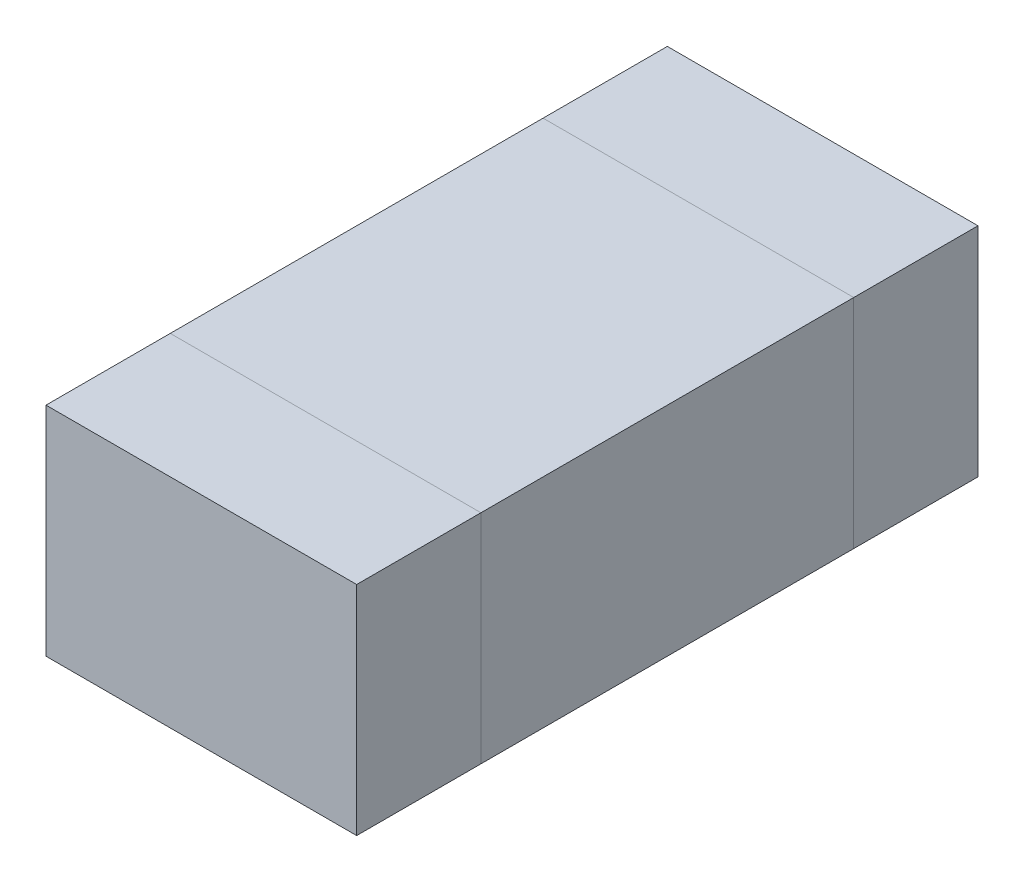
ISO-10303-21;
HEADER;
FILE_DESCRIPTION(('STEP AP214'),'2;1');
FILE_NAME('part.step','',(''),(''),'','','');
FILE_SCHEMA(('AUTOMOTIVE_DESIGN { 1 0 10303 214 1 1 1 1 }'));
ENDSEC;
DATA;
#1=APPLICATION_CONTEXT('core data for automotive mechanical design processes');
#2=APPLICATION_PROTOCOL_DEFINITION('international standard','automotive_design',2000,#1);
#3=PRODUCT_CONTEXT('',#1,'mechanical');
#4=PRODUCT('Part','Part','',(#3));
#5=PRODUCT_RELATED_PRODUCT_CATEGORY('part','',(#4));
#6=PRODUCT_DEFINITION_FORMATION('','',#4);
#7=PRODUCT_DEFINITION_CONTEXT('part definition',#1,'design');
#8=PRODUCT_DEFINITION('design','',#6,#7);
#9=PRODUCT_DEFINITION_SHAPE('','',#8);
#10=(LENGTH_UNIT() NAMED_UNIT(*) SI_UNIT(.MILLI.,.METRE.));
#11=(NAMED_UNIT(*) PLANE_ANGLE_UNIT() SI_UNIT($,.RADIAN.));
#12=(NAMED_UNIT(*) SI_UNIT($,.STERADIAN.) SOLID_ANGLE_UNIT());
#13=UNCERTAINTY_MEASURE_WITH_UNIT(LENGTH_MEASURE(1.E-05),#10,'distance_accuracy_value','');
#14=(GEOMETRIC_REPRESENTATION_CONTEXT(3) GLOBAL_UNCERTAINTY_ASSIGNED_CONTEXT((#13)) GLOBAL_UNIT_ASSIGNED_CONTEXT((#10,
#11,#12)) REPRESENTATION_CONTEXT('',''));
#15=CARTESIAN_POINT('',(0.,0.,0.));
#16=DIRECTION('',(0.,0.,1.));
#17=DIRECTION('',(1.,0.,0.));
#18=AXIS2_PLACEMENT_3D('',#15,#16,#17);
#19=CARTESIAN_POINT('',(0.,0.35,0.));
#20=DIRECTION('',(0.,1.,0.));
#21=DIRECTION('',(0.,0.,1.));
#22=AXIS2_PLACEMENT_3D('',#19,#20,#21);
#23=PLANE('',#22);
#24=DIRECTION('',(0.,0.,-1.));
#25=VECTOR('',#24,1.);
#26=CARTESIAN_POINT('',(-0.25,0.35,-0.3));
#27=LINE('',#26,#25);
#28=CARTESIAN_POINT('',(-0.25,0.35,-0.3));
#29=VERTEX_POINT('',#28);
#30=CARTESIAN_POINT('',(-0.25,0.35,-0.5));
#31=VERTEX_POINT('',#30);
#32=EDGE_CURVE('E51',#29,#31,#27,.T.);
#33=ORIENTED_EDGE('',*,*,#32,.F.);
#34=DIRECTION('',(-1.,0.,0.));
#35=VECTOR('',#34,1.);
#36=CARTESIAN_POINT('',(-0.25,0.35,-0.3));
#37=LINE('',#36,#35);
#38=CARTESIAN_POINT('',(0.25,0.35,-0.3));
#39=VERTEX_POINT('',#38);
#40=EDGE_CURVE('E74',#39,#29,#37,.T.);
#41=ORIENTED_EDGE('',*,*,#40,.F.);
#42=DIRECTION('',(0.,0.,1.));
#43=VECTOR('',#42,1.);
#44=CARTESIAN_POINT('',(0.25,0.35,-0.3));
#45=LINE('',#44,#43);
#46=CARTESIAN_POINT('',(0.25,0.35,-0.5));
#47=VERTEX_POINT('',#46);
#48=EDGE_CURVE('E79',#47,#39,#45,.T.);
#49=ORIENTED_EDGE('',*,*,#48,.F.);
#50=DIRECTION('',(1.,0.,0.));
#51=VECTOR('',#50,1.);
#52=CARTESIAN_POINT('',(-0.25,0.35,-0.5));
#53=LINE('',#52,#51);
#54=EDGE_CURVE('E94',#31,#47,#53,.T.);
#55=ORIENTED_EDGE('',*,*,#54,.F.);
#56=EDGE_LOOP('',(#33,#41,#49,#55));
#57=FACE_BOUND('',#56,.T.);
#58=ADVANCED_FACE('F43',(#57),#23,.T.);
#59=CARTESIAN_POINT('',(0.,0.,0.));
#60=DIRECTION('',(0.,-1.,0.));
#61=DIRECTION('',(0.,0.,-1.));
#62=AXIS2_PLACEMENT_3D('',#59,#60,#61);
#63=PLANE('',#62);
#64=DIRECTION('',(0.,0.,-1.));
#65=VECTOR('',#64,1.);
#66=CARTESIAN_POINT('',(-0.25,0.,-0.3));
#67=LINE('',#66,#65);
#68=CARTESIAN_POINT('',(-0.25,0.,-0.3));
#69=VERTEX_POINT('',#68);
#70=CARTESIAN_POINT('',(-0.25,0.,-0.5));
#71=VERTEX_POINT('',#70);
#72=EDGE_CURVE('E103',#69,#71,#67,.T.);
#73=ORIENTED_EDGE('',*,*,#72,.T.);
#74=DIRECTION('',(1.,0.,0.));
#75=VECTOR('',#74,1.);
#76=CARTESIAN_POINT('',(-0.25,0.,-0.5));
#77=LINE('',#76,#75);
#78=CARTESIAN_POINT('',(0.25,0.,-0.5));
#79=VERTEX_POINT('',#78);
#80=EDGE_CURVE('E92',#71,#79,#77,.T.);
#81=ORIENTED_EDGE('',*,*,#80,.T.);
#82=DIRECTION('',(0.,0.,1.));
#83=VECTOR('',#82,1.);
#84=CARTESIAN_POINT('',(0.25,0.,-0.3));
#85=LINE('',#84,#83);
#86=CARTESIAN_POINT('',(0.25,0.,-0.3));
#87=VERTEX_POINT('',#86);
#88=EDGE_CURVE('E95',#79,#87,#85,.T.);
#89=ORIENTED_EDGE('',*,*,#88,.T.);
#90=DIRECTION('',(-1.,0.,0.));
#91=VECTOR('',#90,1.);
#92=CARTESIAN_POINT('',(-0.25,0.,-0.3));
#93=LINE('',#92,#91);
#94=EDGE_CURVE('E100',#87,#69,#93,.T.);
#95=ORIENTED_EDGE('',*,*,#94,.T.);
#96=EDGE_LOOP('',(#73,#81,#89,#95));
#97=FACE_BOUND('',#96,.T.);
#98=ADVANCED_FACE('F102',(#97),#63,.T.);
#99=CARTESIAN_POINT('',(-0.25,0.888516480713451,-0.5));
#100=DIRECTION('',(0.,0.,-1.));
#101=DIRECTION('',(-1.,0.,0.));
#102=AXIS2_PLACEMENT_3D('',#99,#100,#101);
#103=PLANE('',#102);
#104=DIRECTION('',(0.,-1.,0.));
#105=VECTOR('',#104,1.);
#106=CARTESIAN_POINT('',(-0.25,0.888516480713451,-0.5));
#107=LINE('',#106,#105);
#108=EDGE_CURVE('E12',#31,#71,#107,.T.);
#109=ORIENTED_EDGE('',*,*,#108,.F.);
#110=ORIENTED_EDGE('',*,*,#54,.T.);
#111=DIRECTION('',(0.,-1.,0.));
#112=VECTOR('',#111,1.);
#113=CARTESIAN_POINT('',(0.25,0.888516480713451,-0.5));
#114=LINE('',#113,#112);
#115=EDGE_CURVE('E89',#47,#79,#114,.T.);
#116=ORIENTED_EDGE('',*,*,#115,.T.);
#117=ORIENTED_EDGE('',*,*,#80,.F.);
#118=EDGE_LOOP('',(#109,#110,#116,#117));
#119=FACE_BOUND('',#118,.T.);
#120=ADVANCED_FACE('F90',(#119),#103,.T.);
#121=CARTESIAN_POINT('',(0.25,0.888516480713451,-0.3));
#122=DIRECTION('',(1.,0.,0.));
#123=DIRECTION('',(0.,0.,-1.));
#124=AXIS2_PLACEMENT_3D('',#121,#122,#123);
#125=PLANE('',#124);
#126=ORIENTED_EDGE('',*,*,#115,.F.);
#127=ORIENTED_EDGE('',*,*,#48,.T.);
#128=DIRECTION('',(0.,-1.,0.));
#129=VECTOR('',#128,1.);
#130=CARTESIAN_POINT('',(0.25,0.888516480713451,-0.3));
#131=LINE('',#130,#129);
#132=EDGE_CURVE('E84',#39,#87,#131,.T.);
#133=ORIENTED_EDGE('',*,*,#132,.T.);
#134=ORIENTED_EDGE('',*,*,#88,.F.);
#135=EDGE_LOOP('',(#126,#127,#133,#134));
#136=FACE_BOUND('',#135,.T.);
#137=ADVANCED_FACE('F96',(#136),#125,.T.);
#138=CARTESIAN_POINT('',(-0.25,0.888516480713451,-0.3));
#139=DIRECTION('',(0.,0.,1.));
#140=DIRECTION('',(1.,0.,0.));
#141=AXIS2_PLACEMENT_3D('',#138,#139,#140);
#142=PLANE('',#141);
#143=ORIENTED_EDGE('',*,*,#132,.F.);
#144=ORIENTED_EDGE('',*,*,#40,.T.);
#145=DIRECTION('',(0.,-1.,0.));
#146=VECTOR('',#145,1.);
#147=CARTESIAN_POINT('',(-0.25,0.888516480713451,-0.3));
#148=LINE('',#147,#146);
#149=EDGE_CURVE('E110',#29,#69,#148,.T.);
#150=ORIENTED_EDGE('',*,*,#149,.T.);
#151=ORIENTED_EDGE('',*,*,#94,.F.);
#152=EDGE_LOOP('',(#143,#144,#150,#151));
#153=FACE_BOUND('',#152,.T.);
#154=ADVANCED_FACE('F116',(#153),#142,.T.);
#155=CARTESIAN_POINT('',(-0.25,0.888516480713451,-0.3));
#156=DIRECTION('',(-1.,0.,0.));
#157=DIRECTION('',(0.,0.,1.));
#158=AXIS2_PLACEMENT_3D('',#155,#156,#157);
#159=PLANE('',#158);
#160=ORIENTED_EDGE('',*,*,#149,.F.);
#161=ORIENTED_EDGE('',*,*,#32,.T.);
#162=ORIENTED_EDGE('',*,*,#108,.T.);
#163=ORIENTED_EDGE('',*,*,#72,.F.);
#164=EDGE_LOOP('',(#160,#161,#162,#163));
#165=FACE_BOUND('',#164,.T.);
#166=ADVANCED_FACE('F117',(#165),#159,.T.);
#167=CLOSED_SHELL('',(#58,#98,#120,#137,#154,#166));
#168=MANIFOLD_SOLID_BREP('B2',#167);
#169=CARTESIAN_POINT('',(0.,0.35,0.));
#170=DIRECTION('',(0.,1.,0.));
#171=DIRECTION('',(0.,0.,1.));
#172=AXIS2_PLACEMENT_3D('',#169,#170,#171);
#173=PLANE('',#172);
#174=DIRECTION('',(0.,0.,-1.));
#175=VECTOR('',#174,1.);
#176=CARTESIAN_POINT('',(-0.25,0.35,0.3));
#177=LINE('',#176,#175);
#178=CARTESIAN_POINT('',(-0.25,0.35,0.5));
#179=VERTEX_POINT('',#178);
#180=CARTESIAN_POINT('',(-0.25,0.35,0.3));
#181=VERTEX_POINT('',#180);
#182=EDGE_CURVE('E183',#179,#181,#177,.T.);
#183=ORIENTED_EDGE('',*,*,#182,.F.);
#184=DIRECTION('',(-1.,0.,0.));
#185=VECTOR('',#184,1.);
#186=CARTESIAN_POINT('',(-0.25,0.35,0.5));
#187=LINE('',#186,#185);
#188=CARTESIAN_POINT('',(0.25,0.35,0.5));
#189=VERTEX_POINT('',#188);
#190=EDGE_CURVE('E206',#189,#179,#187,.T.);
#191=ORIENTED_EDGE('',*,*,#190,.F.);
#192=DIRECTION('',(0.,0.,1.));
#193=VECTOR('',#192,1.);
#194=CARTESIAN_POINT('',(0.25,0.35,0.3));
#195=LINE('',#194,#193);
#196=CARTESIAN_POINT('',(0.25,0.35,0.3));
#197=VERTEX_POINT('',#196);
#198=EDGE_CURVE('E211',#197,#189,#195,.T.);
#199=ORIENTED_EDGE('',*,*,#198,.F.);
#200=DIRECTION('',(1.,0.,0.));
#201=VECTOR('',#200,1.);
#202=CARTESIAN_POINT('',(-0.25,0.35,0.3));
#203=LINE('',#202,#201);
#204=EDGE_CURVE('E226',#181,#197,#203,.T.);
#205=ORIENTED_EDGE('',*,*,#204,.F.);
#206=EDGE_LOOP('',(#183,#191,#199,#205));
#207=FACE_BOUND('',#206,.T.);
#208=ADVANCED_FACE('F175',(#207),#173,.T.);
#209=CARTESIAN_POINT('',(0.,0.,0.));
#210=DIRECTION('',(0.,1.,0.));
#211=DIRECTION('',(0.,0.,1.));
#212=AXIS2_PLACEMENT_3D('',#209,#210,#211);
#213=PLANE('',#212);
#214=DIRECTION('',(0.,0.,-1.));
#215=VECTOR('',#214,1.);
#216=CARTESIAN_POINT('',(-0.25,0.,0.3));
#217=LINE('',#216,#215);
#218=CARTESIAN_POINT('',(-0.25,0.,0.5));
#219=VERTEX_POINT('',#218);
#220=CARTESIAN_POINT('',(-0.25,0.,0.3));
#221=VERTEX_POINT('',#220);
#222=EDGE_CURVE('E235',#219,#221,#217,.T.);
#223=ORIENTED_EDGE('',*,*,#222,.T.);
#224=DIRECTION('',(1.,0.,0.));
#225=VECTOR('',#224,1.);
#226=CARTESIAN_POINT('',(-0.25,0.,0.3));
#227=LINE('',#226,#225);
#228=CARTESIAN_POINT('',(0.25,0.,0.3));
#229=VERTEX_POINT('',#228);
#230=EDGE_CURVE('E224',#221,#229,#227,.T.);
#231=ORIENTED_EDGE('',*,*,#230,.T.);
#232=DIRECTION('',(0.,0.,1.));
#233=VECTOR('',#232,1.);
#234=CARTESIAN_POINT('',(0.25,0.,0.3));
#235=LINE('',#234,#233);
#236=CARTESIAN_POINT('',(0.25,0.,0.5));
#237=VERTEX_POINT('',#236);
#238=EDGE_CURVE('E227',#229,#237,#235,.T.);
#239=ORIENTED_EDGE('',*,*,#238,.T.);
#240=DIRECTION('',(-1.,0.,0.));
#241=VECTOR('',#240,1.);
#242=CARTESIAN_POINT('',(-0.25,0.,0.5));
#243=LINE('',#242,#241);
#244=EDGE_CURVE('E232',#237,#219,#243,.T.);
#245=ORIENTED_EDGE('',*,*,#244,.T.);
#246=EDGE_LOOP('',(#223,#231,#239,#245));
#247=FACE_BOUND('',#246,.T.);
#248=ADVANCED_FACE('F234',(#247),#213,.F.);
#249=CARTESIAN_POINT('',(-0.25,0.88851648071345,0.3));
#250=DIRECTION('',(0.,0.,-1.));
#251=DIRECTION('',(-1.,0.,0.));
#252=AXIS2_PLACEMENT_3D('',#249,#250,#251);
#253=PLANE('',#252);
#254=DIRECTION('',(0.,-1.,0.));
#255=VECTOR('',#254,1.);
#256=CARTESIAN_POINT('',(-0.25,0.88851648071345,0.3));
#257=LINE('',#256,#255);
#258=EDGE_CURVE('E41',#181,#221,#257,.T.);
#259=ORIENTED_EDGE('',*,*,#258,.F.);
#260=ORIENTED_EDGE('',*,*,#204,.T.);
#261=DIRECTION('',(0.,-1.,0.));
#262=VECTOR('',#261,1.);
#263=CARTESIAN_POINT('',(0.25,0.88851648071345,0.3));
#264=LINE('',#263,#262);
#265=EDGE_CURVE('E221',#197,#229,#264,.T.);
#266=ORIENTED_EDGE('',*,*,#265,.T.);
#267=ORIENTED_EDGE('',*,*,#230,.F.);
#268=EDGE_LOOP('',(#259,#260,#266,#267));
#269=FACE_BOUND('',#268,.T.);
#270=ADVANCED_FACE('F222',(#269),#253,.T.);
#271=CARTESIAN_POINT('',(0.25,0.88851648071345,0.3));
#272=DIRECTION('',(1.,0.,0.));
#273=DIRECTION('',(0.,0.,-1.));
#274=AXIS2_PLACEMENT_3D('',#271,#272,#273);
#275=PLANE('',#274);
#276=ORIENTED_EDGE('',*,*,#265,.F.);
#277=ORIENTED_EDGE('',*,*,#198,.T.);
#278=DIRECTION('',(0.,-1.,0.));
#279=VECTOR('',#278,1.);
#280=CARTESIAN_POINT('',(0.25,0.88851648071345,0.5));
#281=LINE('',#280,#279);
#282=EDGE_CURVE('E216',#189,#237,#281,.T.);
#283=ORIENTED_EDGE('',*,*,#282,.T.);
#284=ORIENTED_EDGE('',*,*,#238,.F.);
#285=EDGE_LOOP('',(#276,#277,#283,#284));
#286=FACE_BOUND('',#285,.T.);
#287=ADVANCED_FACE('F228',(#286),#275,.T.);
#288=CARTESIAN_POINT('',(-0.25,0.88851648071345,0.5));
#289=DIRECTION('',(0.,0.,1.));
#290=DIRECTION('',(1.,0.,0.));
#291=AXIS2_PLACEMENT_3D('',#288,#289,#290);
#292=PLANE('',#291);
#293=ORIENTED_EDGE('',*,*,#282,.F.);
#294=ORIENTED_EDGE('',*,*,#190,.T.);
#295=DIRECTION('',(0.,-1.,0.));
#296=VECTOR('',#295,1.);
#297=CARTESIAN_POINT('',(-0.25,0.88851648071345,0.5));
#298=LINE('',#297,#296);
#299=EDGE_CURVE('E242',#179,#219,#298,.T.);
#300=ORIENTED_EDGE('',*,*,#299,.T.);
#301=ORIENTED_EDGE('',*,*,#244,.F.);
#302=EDGE_LOOP('',(#293,#294,#300,#301));
#303=FACE_BOUND('',#302,.T.);
#304=ADVANCED_FACE('F248',(#303),#292,.T.);
#305=CARTESIAN_POINT('',(-0.25,0.88851648071345,0.3));
#306=DIRECTION('',(-1.,0.,0.));
#307=DIRECTION('',(0.,0.,1.));
#308=AXIS2_PLACEMENT_3D('',#305,#306,#307);
#309=PLANE('',#308);
#310=ORIENTED_EDGE('',*,*,#299,.F.);
#311=ORIENTED_EDGE('',*,*,#182,.T.);
#312=ORIENTED_EDGE('',*,*,#258,.T.);
#313=ORIENTED_EDGE('',*,*,#222,.F.);
#314=EDGE_LOOP('',(#310,#311,#312,#313));
#315=FACE_BOUND('',#314,.T.);
#316=ADVANCED_FACE('F249',(#315),#309,.T.);
#317=CLOSED_SHELL('',(#208,#248,#270,#287,#304,#316));
#318=MANIFOLD_SOLID_BREP('B6',#317);
#319=CARTESIAN_POINT('',(0.25,0.35,-0.3));
#320=DIRECTION('',(-1.,0.,0.));
#321=DIRECTION('',(0.,0.,1.));
#322=AXIS2_PLACEMENT_3D('',#319,#320,#321);
#323=PLANE('',#322);
#324=DIRECTION('',(0.,0.,-1.));
#325=VECTOR('',#324,1.);
#326=CARTESIAN_POINT('',(0.25,0.,-0.3));
#327=LINE('',#326,#325);
#328=CARTESIAN_POINT('',(0.25,0.,0.3));
#329=VERTEX_POINT('',#328);
#330=CARTESIAN_POINT('',(0.25,0.,-0.3));
#331=VERTEX_POINT('',#330);
#332=EDGE_CURVE('E361',#329,#331,#327,.T.);
#333=ORIENTED_EDGE('',*,*,#332,.T.);
#334=DIRECTION('',(0.,-1.,0.));
#335=VECTOR('',#334,1.);
#336=CARTESIAN_POINT('',(0.25,0.35,-0.3));
#337=LINE('',#336,#335);
#338=CARTESIAN_POINT('',(0.25,0.35,-0.3));
#339=VERTEX_POINT('',#338);
#340=EDGE_CURVE('E173',#339,#331,#337,.T.);
#341=ORIENTED_EDGE('',*,*,#340,.F.);
#342=DIRECTION('',(0.,0.,-1.));
#343=VECTOR('',#342,1.);
#344=CARTESIAN_POINT('',(0.25,0.35,-0.3));
#345=LINE('',#344,#343);
#346=CARTESIAN_POINT('',(0.25,0.35,0.3));
#347=VERTEX_POINT('',#346);
#348=EDGE_CURVE('E349',#347,#339,#345,.T.);
#349=ORIENTED_EDGE('',*,*,#348,.F.);
#350=DIRECTION('',(0.,-1.,0.));
#351=VECTOR('',#350,1.);
#352=CARTESIAN_POINT('',(0.25,0.35,0.3));
#353=LINE('',#352,#351);
#354=EDGE_CURVE('E357',#347,#329,#353,.T.);
#355=ORIENTED_EDGE('',*,*,#354,.T.);
#356=EDGE_LOOP('',(#333,#341,#349,#355));
#357=FACE_BOUND('',#356,.T.);
#358=ADVANCED_FACE('F298',(#357),#323,.F.);
#359=CARTESIAN_POINT('',(-0.25,0.35,-0.3));
#360=DIRECTION('',(0.,0.,1.));
#361=DIRECTION('',(1.,0.,0.));
#362=AXIS2_PLACEMENT_3D('',#359,#360,#361);
#363=PLANE('',#362);
#364=DIRECTION('',(-1.,0.,0.));
#365=VECTOR('',#364,1.);
#366=CARTESIAN_POINT('',(-0.25,0.,-0.3));
#367=LINE('',#366,#365);
#368=CARTESIAN_POINT('',(-0.25,0.,-0.3));
#369=VERTEX_POINT('',#368);
#370=EDGE_CURVE('E353',#331,#369,#367,.T.);
#371=ORIENTED_EDGE('',*,*,#370,.T.);
#372=DIRECTION('',(0.,-1.,0.));
#373=VECTOR('',#372,1.);
#374=CARTESIAN_POINT('',(-0.25,0.35,-0.3));
#375=LINE('',#374,#373);
#376=CARTESIAN_POINT('',(-0.25,0.35,-0.3));
#377=VERTEX_POINT('',#376);
#378=EDGE_CURVE('E306',#377,#369,#375,.T.);
#379=ORIENTED_EDGE('',*,*,#378,.F.);
#380=DIRECTION('',(-1.,0.,0.));
#381=VECTOR('',#380,1.);
#382=CARTESIAN_POINT('',(-0.25,0.35,-0.3));
#383=LINE('',#382,#381);
#384=EDGE_CURVE('E344',#339,#377,#383,.T.);
#385=ORIENTED_EDGE('',*,*,#384,.F.);
#386=ORIENTED_EDGE('',*,*,#340,.T.);
#387=EDGE_LOOP('',(#371,#379,#385,#386));
#388=FACE_BOUND('',#387,.T.);
#389=ADVANCED_FACE('F352',(#388),#363,.F.);
#390=CARTESIAN_POINT('',(-0.25,0.35,-0.3));
#391=DIRECTION('',(1.,0.,0.));
#392=DIRECTION('',(0.,0.,-1.));
#393=AXIS2_PLACEMENT_3D('',#390,#391,#392);
#394=PLANE('',#393);
#395=DIRECTION('',(0.,0.,1.));
#396=VECTOR('',#395,1.);
#397=CARTESIAN_POINT('',(-0.25,0.,-0.3));
#398=LINE('',#397,#396);
#399=CARTESIAN_POINT('',(-0.25,0.,0.3));
#400=VERTEX_POINT('',#399);
#401=EDGE_CURVE('E331',#369,#400,#398,.T.);
#402=ORIENTED_EDGE('',*,*,#401,.T.);
#403=DIRECTION('',(0.,-1.,0.));
#404=VECTOR('',#403,1.);
#405=CARTESIAN_POINT('',(-0.25,0.35,0.3));
#406=LINE('',#405,#404);
#407=CARTESIAN_POINT('',(-0.25,0.35,0.3));
#408=VERTEX_POINT('',#407);
#409=EDGE_CURVE('E354',#408,#400,#406,.T.);
#410=ORIENTED_EDGE('',*,*,#409,.F.);
#411=DIRECTION('',(0.,0.,1.));
#412=VECTOR('',#411,1.);
#413=CARTESIAN_POINT('',(-0.25,0.35,-0.3));
#414=LINE('',#413,#412);
#415=EDGE_CURVE('E347',#377,#408,#414,.T.);
#416=ORIENTED_EDGE('',*,*,#415,.F.);
#417=ORIENTED_EDGE('',*,*,#378,.T.);
#418=EDGE_LOOP('',(#402,#410,#416,#417));
#419=FACE_BOUND('',#418,.T.);
#420=ADVANCED_FACE('F355',(#419),#394,.F.);
#421=CARTESIAN_POINT('',(-0.25,0.35,0.3));
#422=DIRECTION('',(0.,0.,-1.));
#423=DIRECTION('',(-1.,0.,0.));
#424=AXIS2_PLACEMENT_3D('',#421,#422,#423);
#425=PLANE('',#424);
#426=DIRECTION('',(1.,0.,0.));
#427=VECTOR('',#426,1.);
#428=CARTESIAN_POINT('',(-0.25,0.,0.3));
#429=LINE('',#428,#427);
#430=EDGE_CURVE('E337',#400,#329,#429,.T.);
#431=ORIENTED_EDGE('',*,*,#430,.T.);
#432=ORIENTED_EDGE('',*,*,#354,.F.);
#433=DIRECTION('',(1.,0.,0.));
#434=VECTOR('',#433,1.);
#435=CARTESIAN_POINT('',(-0.25,0.35,0.3));
#436=LINE('',#435,#434);
#437=EDGE_CURVE('E314',#408,#347,#436,.T.);
#438=ORIENTED_EDGE('',*,*,#437,.F.);
#439=ORIENTED_EDGE('',*,*,#409,.T.);
#440=EDGE_LOOP('',(#431,#432,#438,#439));
#441=FACE_BOUND('',#440,.T.);
#442=ADVANCED_FACE('F368',(#441),#425,.F.);
#443=CARTESIAN_POINT('',(0.,0.35,0.));
#444=DIRECTION('',(0.,1.,0.));
#445=DIRECTION('',(0.,0.,1.));
#446=AXIS2_PLACEMENT_3D('',#443,#444,#445);
#447=PLANE('',#446);
#448=ORIENTED_EDGE('',*,*,#348,.T.);
#449=ORIENTED_EDGE('',*,*,#384,.T.);
#450=ORIENTED_EDGE('',*,*,#415,.T.);
#451=ORIENTED_EDGE('',*,*,#437,.T.);
#452=EDGE_LOOP('',(#448,#449,#450,#451));
#453=FACE_BOUND('',#452,.T.);
#454=ADVANCED_FACE('F345',(#453),#447,.T.);
#455=CARTESIAN_POINT('',(0.,0.,0.));
#456=DIRECTION('',(0.,1.,0.));
#457=DIRECTION('',(0.,0.,1.));
#458=AXIS2_PLACEMENT_3D('',#455,#456,#457);
#459=PLANE('',#458);
#460=ORIENTED_EDGE('',*,*,#332,.F.);
#461=ORIENTED_EDGE('',*,*,#430,.F.);
#462=ORIENTED_EDGE('',*,*,#401,.F.);
#463=ORIENTED_EDGE('',*,*,#370,.F.);
#464=EDGE_LOOP('',(#460,#461,#462,#463));
#465=FACE_BOUND('',#464,.T.);
#466=ADVANCED_FACE('F371',(#465),#459,.F.);
#467=CLOSED_SHELL('',(#358,#389,#420,#442,#454,#466));
#468=MANIFOLD_SOLID_BREP('B35',#467);
#469=ADVANCED_BREP_SHAPE_REPRESENTATION('',(#18,#168,#318,#468),#14);
#470=SHAPE_DEFINITION_REPRESENTATION(#9,#469);
ENDSEC;
END-ISO-10303-21;
